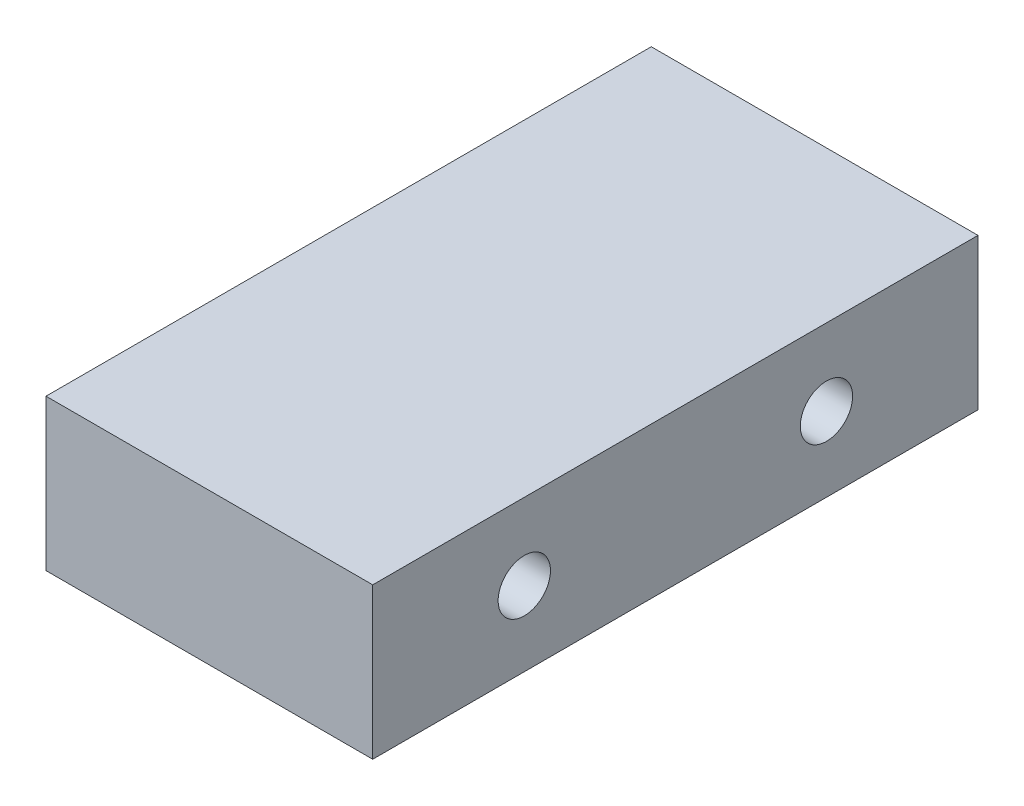
ISO-10303-21;
HEADER;
FILE_DESCRIPTION(('STEP AP214'),'2;1');
FILE_NAME('part.step','',(''),(''),'','','');
FILE_SCHEMA(('AUTOMOTIVE_DESIGN { 1 0 10303 214 1 1 1 1 }'));
ENDSEC;
DATA;
#1=APPLICATION_CONTEXT('core data for automotive mechanical design processes');
#2=APPLICATION_PROTOCOL_DEFINITION('international standard','automotive_design',2000,#1);
#3=PRODUCT_CONTEXT('',#1,'mechanical');
#4=PRODUCT('Part','Part','',(#3));
#5=PRODUCT_RELATED_PRODUCT_CATEGORY('part','',(#4));
#6=PRODUCT_DEFINITION_FORMATION('','',#4);
#7=PRODUCT_DEFINITION_CONTEXT('part definition',#1,'design');
#8=PRODUCT_DEFINITION('design','',#6,#7);
#9=PRODUCT_DEFINITION_SHAPE('','',#8);
#10=(LENGTH_UNIT() NAMED_UNIT(*) SI_UNIT(.MILLI.,.METRE.));
#11=(NAMED_UNIT(*) PLANE_ANGLE_UNIT() SI_UNIT($,.RADIAN.));
#12=(NAMED_UNIT(*) SI_UNIT($,.STERADIAN.) SOLID_ANGLE_UNIT());
#13=UNCERTAINTY_MEASURE_WITH_UNIT(LENGTH_MEASURE(1.E-05),#10,'distance_accuracy_value','');
#14=(GEOMETRIC_REPRESENTATION_CONTEXT(3) GLOBAL_UNCERTAINTY_ASSIGNED_CONTEXT((#13)) GLOBAL_UNIT_ASSIGNED_CONTEXT((#10,
#11,#12)) REPRESENTATION_CONTEXT('',''));
#15=CARTESIAN_POINT('',(0.,0.,0.));
#16=DIRECTION('',(0.,0.,1.));
#17=DIRECTION('',(1.,0.,0.));
#18=AXIS2_PLACEMENT_3D('',#15,#16,#17);
#19=CARTESIAN_POINT('',(-3.18,19.87,-19.09));
#20=DIRECTION('',(-1.,0.,0.));
#21=DIRECTION('',(0.,-1.,0.));
#22=AXIS2_PLACEMENT_3D('',#19,#20,#21);
#23=PLANE('',#22);
#24=DIRECTION('',(0.,0.628988215202953,0.777414834651232));
#25=VECTOR('',#24,1.);
#26=CARTESIAN_POINT('',(-3.18000000000001,0.,6.31));
#27=LINE('',#26,#25);
#28=CARTESIAN_POINT('',(-3.18000000000001,0.,6.31));
#29=VERTEX_POINT('',#28);
#30=CARTESIAN_POINT('',(-3.18,10.34,19.09));
#31=VERTEX_POINT('',#30);
#32=EDGE_CURVE('E92',#29,#31,#27,.T.);
#33=ORIENTED_EDGE('',*,*,#32,.T.);
#34=DIRECTION('',(0.,-1.,0.));
#35=VECTOR('',#34,1.);
#36=CARTESIAN_POINT('',(-3.18,19.87,19.09));
#37=LINE('',#36,#35);
#38=CARTESIAN_POINT('',(-3.18,19.87,19.09));
#39=VERTEX_POINT('',#38);
#40=EDGE_CURVE('E103',#39,#31,#37,.T.);
#41=ORIENTED_EDGE('',*,*,#40,.F.);
#42=DIRECTION('',(0.,0.,1.));
#43=VECTOR('',#42,1.);
#44=CARTESIAN_POINT('',(-3.18,19.87,-19.09));
#45=LINE('',#44,#43);
#46=CARTESIAN_POINT('',(-3.18,19.87,-19.09));
#47=VERTEX_POINT('',#46);
#48=EDGE_CURVE('E11',#47,#39,#45,.T.);
#49=ORIENTED_EDGE('',*,*,#48,.F.);
#50=DIRECTION('',(0.,-1.,0.));
#51=VECTOR('',#50,1.);
#52=CARTESIAN_POINT('',(-3.18,19.87,-19.09));
#53=LINE('',#52,#51);
#54=CARTESIAN_POINT('',(-3.18,10.34,-19.09));
#55=VERTEX_POINT('',#54);
#56=EDGE_CURVE('E123',#47,#55,#53,.T.);
#57=ORIENTED_EDGE('',*,*,#56,.T.);
#58=DIRECTION('',(0.,-0.628988215202953,0.777414834651232));
#59=VECTOR('',#58,1.);
#60=CARTESIAN_POINT('',(-3.18,10.34,-19.09));
#61=LINE('',#60,#59);
#62=CARTESIAN_POINT('',(-3.18000000000001,0.,-6.31));
#63=VERTEX_POINT('',#62);
#64=EDGE_CURVE('E47',#55,#63,#61,.T.);
#65=ORIENTED_EDGE('',*,*,#64,.T.);
#66=DIRECTION('',(0.,0.,1.));
#67=VECTOR('',#66,1.);
#68=CARTESIAN_POINT('',(-3.18,0.,-19.09));
#69=LINE('',#68,#67);
#70=EDGE_CURVE('E34',#63,#29,#69,.T.);
#71=ORIENTED_EDGE('',*,*,#70,.T.);
#72=EDGE_LOOP('',(#33,#41,#49,#57,#65,#71));
#73=FACE_BOUND('',#72,.T.);
#74=ADVANCED_FACE('F31',(#73),#23,.T.);
#75=CARTESIAN_POINT('',(17.43,19.87,-19.09));
#76=DIRECTION('',(0.,1.,0.));
#77=DIRECTION('',(-1.,0.,0.));
#78=AXIS2_PLACEMENT_3D('',#75,#76,#77);
#79=PLANE('',#78);
#80=ORIENTED_EDGE('',*,*,#48,.T.);
#81=DIRECTION('',(-1.,0.,0.));
#82=VECTOR('',#81,1.);
#83=CARTESIAN_POINT('',(17.43,19.87,19.09));
#84=LINE('',#83,#82);
#85=CARTESIAN_POINT('',(17.43,19.87,19.09));
#86=VERTEX_POINT('',#85);
#87=EDGE_CURVE('E110',#86,#39,#84,.T.);
#88=ORIENTED_EDGE('',*,*,#87,.F.);
#89=DIRECTION('',(0.,0.,1.));
#90=VECTOR('',#89,1.);
#91=CARTESIAN_POINT('',(17.43,19.87,-19.09));
#92=LINE('',#91,#90);
#93=CARTESIAN_POINT('',(17.43,19.87,-19.09));
#94=VERTEX_POINT('',#93);
#95=EDGE_CURVE('E39',#94,#86,#92,.T.);
#96=ORIENTED_EDGE('',*,*,#95,.F.);
#97=DIRECTION('',(-1.,0.,0.));
#98=VECTOR('',#97,1.);
#99=CARTESIAN_POINT('',(17.43,19.87,-19.09));
#100=LINE('',#99,#98);
#101=EDGE_CURVE('E131',#94,#47,#100,.T.);
#102=ORIENTED_EDGE('',*,*,#101,.T.);
#103=EDGE_LOOP('',(#80,#88,#96,#102));
#104=FACE_BOUND('',#103,.T.);
#105=ADVANCED_FACE('F170',(#104),#79,.T.);
#106=CARTESIAN_POINT('',(17.43,10.34,-19.09));
#107=DIRECTION('',(1.,0.,0.));
#108=DIRECTION('',(0.,0.,-1.));
#109=AXIS2_PLACEMENT_3D('',#106,#107,#108);
#110=PLANE('',#109);
#111=CARTESIAN_POINT('',(17.43,15.045,9.52999999999999));
#112=DIRECTION('',(1.,0.,0.));
#113=DIRECTION('',(0.,0.,-1.));
#114=AXIS2_PLACEMENT_3D('',#111,#112,#113);
#115=CIRCLE('',#114,1.65);
#116=CARTESIAN_POINT('',(17.43,15.045,7.87999999999999));
#117=VERTEX_POINT('',#116);
#118=EDGE_CURVE('E201',#117,#117,#115,.T.);
#119=ORIENTED_EDGE('',*,*,#118,.F.);
#120=EDGE_LOOP('',(#119));
#121=FACE_BOUND('',#120,.T.);
#122=CARTESIAN_POINT('',(17.43,15.045,-9.52999999999999));
#123=DIRECTION('',(1.,0.,0.));
#124=DIRECTION('',(0.,0.,-1.));
#125=AXIS2_PLACEMENT_3D('',#122,#123,#124);
#126=CIRCLE('',#125,1.65);
#127=CARTESIAN_POINT('',(17.43,15.045,-11.18));
#128=VERTEX_POINT('',#127);
#129=EDGE_CURVE('E195',#128,#128,#126,.T.);
#130=ORIENTED_EDGE('',*,*,#129,.F.);
#131=EDGE_LOOP('',(#130));
#132=FACE_BOUND('',#131,.T.);
#133=ORIENTED_EDGE('',*,*,#95,.T.);
#134=DIRECTION('',(0.,1.,0.));
#135=VECTOR('',#134,1.);
#136=CARTESIAN_POINT('',(17.43,10.34,19.09));
#137=LINE('',#136,#135);
#138=CARTESIAN_POINT('',(17.43,10.34,19.09));
#139=VERTEX_POINT('',#138);
#140=EDGE_CURVE('E114',#139,#86,#137,.T.);
#141=ORIENTED_EDGE('',*,*,#140,.F.);
#142=DIRECTION('',(0.,0.,1.));
#143=VECTOR('',#142,1.);
#144=CARTESIAN_POINT('',(17.43,10.34,-19.09));
#145=LINE('',#144,#143);
#146=CARTESIAN_POINT('',(17.43,10.34,-19.09));
#147=VERTEX_POINT('',#146);
#148=EDGE_CURVE('E135',#147,#139,#145,.T.);
#149=ORIENTED_EDGE('',*,*,#148,.F.);
#150=DIRECTION('',(0.,1.,0.));
#151=VECTOR('',#150,1.);
#152=CARTESIAN_POINT('',(17.43,10.34,-19.09));
#153=LINE('',#152,#151);
#154=EDGE_CURVE('E128',#147,#94,#153,.T.);
#155=ORIENTED_EDGE('',*,*,#154,.T.);
#156=EDGE_LOOP('',(#133,#141,#149,#155));
#157=FACE_BOUND('',#156,.T.);
#158=ADVANCED_FACE('F168',(#121,#132,#157),#110,.T.);
#159=CARTESIAN_POINT('',(3.18,10.34,-19.09));
#160=DIRECTION('',(0.,-1.,0.));
#161=DIRECTION('',(1.,0.,0.));
#162=AXIS2_PLACEMENT_3D('',#159,#160,#161);
#163=PLANE('',#162);
#164=ORIENTED_EDGE('',*,*,#148,.T.);
#165=DIRECTION('',(1.,0.,0.));
#166=VECTOR('',#165,1.);
#167=CARTESIAN_POINT('',(3.18,10.34,19.09));
#168=LINE('',#167,#166);
#169=CARTESIAN_POINT('',(3.18,10.34,19.09));
#170=VERTEX_POINT('',#169);
#171=EDGE_CURVE('E111',#170,#139,#168,.T.);
#172=ORIENTED_EDGE('',*,*,#171,.F.);
#173=DIRECTION('',(0.,0.,1.));
#174=VECTOR('',#173,1.);
#175=CARTESIAN_POINT('',(3.18,10.34,-19.09));
#176=LINE('',#175,#174);
#177=CARTESIAN_POINT('',(3.18,10.34,-19.09));
#178=VERTEX_POINT('',#177);
#179=EDGE_CURVE('E137',#178,#170,#176,.T.);
#180=ORIENTED_EDGE('',*,*,#179,.F.);
#181=DIRECTION('',(1.,0.,0.));
#182=VECTOR('',#181,1.);
#183=CARTESIAN_POINT('',(3.18,10.34,-19.09));
#184=LINE('',#183,#182);
#185=EDGE_CURVE('E125',#178,#147,#184,.T.);
#186=ORIENTED_EDGE('',*,*,#185,.T.);
#187=EDGE_LOOP('',(#164,#172,#180,#186));
#188=FACE_BOUND('',#187,.T.);
#189=ADVANCED_FACE('F165',(#188),#163,.T.);
#190=CARTESIAN_POINT('',(3.18,0.,-19.09));
#191=DIRECTION('',(1.,0.,0.));
#192=DIRECTION('',(0.,1.,0.));
#193=AXIS2_PLACEMENT_3D('',#190,#191,#192);
#194=PLANE('',#193);
#195=DIRECTION('',(0.,0.628988215202953,0.777414834651232));
#196=VECTOR('',#195,1.);
#197=CARTESIAN_POINT('',(3.18,0.,6.31));
#198=LINE('',#197,#196);
#199=CARTESIAN_POINT('',(3.18,0.,6.31));
#200=VERTEX_POINT('',#199);
#201=EDGE_CURVE('E95',#200,#170,#198,.T.);
#202=ORIENTED_EDGE('',*,*,#201,.F.);
#203=DIRECTION('',(0.,0.,1.));
#204=VECTOR('',#203,1.);
#205=CARTESIAN_POINT('',(3.18,0.,-19.09));
#206=LINE('',#205,#204);
#207=CARTESIAN_POINT('',(3.18,0.,-6.31));
#208=VERTEX_POINT('',#207);
#209=EDGE_CURVE('E138',#208,#200,#206,.T.);
#210=ORIENTED_EDGE('',*,*,#209,.F.);
#211=DIRECTION('',(0.,-0.628988215202953,0.777414834651232));
#212=VECTOR('',#211,1.);
#213=CARTESIAN_POINT('',(3.18,10.34,-19.09));
#214=LINE('',#213,#212);
#215=EDGE_CURVE('E146',#178,#208,#214,.T.);
#216=ORIENTED_EDGE('',*,*,#215,.F.);
#217=ORIENTED_EDGE('',*,*,#179,.T.);
#218=EDGE_LOOP('',(#202,#210,#216,#217));
#219=FACE_BOUND('',#218,.T.);
#220=ADVANCED_FACE('F145',(#219),#194,.T.);
#221=CARTESIAN_POINT('',(-3.18,0.,-19.09));
#222=DIRECTION('',(0.,-1.,0.));
#223=DIRECTION('',(0.,0.,-1.));
#224=AXIS2_PLACEMENT_3D('',#221,#222,#223);
#225=PLANE('',#224);
#226=CARTESIAN_POINT('',(0.,0.,0.));
#227=DIRECTION('',(0.,-1.,0.));
#228=DIRECTION('',(0.,0.,-1.));
#229=AXIS2_PLACEMENT_3D('',#226,#227,#228);
#230=CIRCLE('',#229,1.125);
#231=CARTESIAN_POINT('',(0.,0.,-1.125));
#232=VERTEX_POINT('',#231);
#233=EDGE_CURVE('E152',#232,#232,#230,.T.);
#234=ORIENTED_EDGE('',*,*,#233,.F.);
#235=EDGE_LOOP('',(#234));
#236=FACE_BOUND('',#235,.T.);
#237=DIRECTION('',(1.,0.,0.));
#238=VECTOR('',#237,1.);
#239=CARTESIAN_POINT('',(-3.18000000000001,0.,6.31));
#240=LINE('',#239,#238);
#241=EDGE_CURVE('E100',#29,#200,#240,.T.);
#242=ORIENTED_EDGE('',*,*,#241,.F.);
#243=ORIENTED_EDGE('',*,*,#70,.F.);
#244=DIRECTION('',(1.,0.,0.));
#245=VECTOR('',#244,1.);
#246=CARTESIAN_POINT('',(-3.18000000000001,0.,-6.31));
#247=LINE('',#246,#245);
#248=EDGE_CURVE('E112',#63,#208,#247,.T.);
#249=ORIENTED_EDGE('',*,*,#248,.T.);
#250=ORIENTED_EDGE('',*,*,#209,.T.);
#251=EDGE_LOOP('',(#242,#243,#249,#250));
#252=FACE_BOUND('',#251,.T.);
#253=ADVANCED_FACE('F142',(#236,#252),#225,.T.);
#254=CARTESIAN_POINT('',(-3.18,0.,-19.09));
#255=DIRECTION('',(0.,0.,1.));
#256=DIRECTION('',(1.,0.,0.));
#257=AXIS2_PLACEMENT_3D('',#254,#255,#256);
#258=PLANE('',#257);
#259=ORIENTED_EDGE('',*,*,#185,.F.);
#260=DIRECTION('',(1.,0.,0.));
#261=VECTOR('',#260,1.);
#262=CARTESIAN_POINT('',(-3.18,10.34,-19.09));
#263=LINE('',#262,#261);
#264=EDGE_CURVE('E117',#55,#178,#263,.T.);
#265=ORIENTED_EDGE('',*,*,#264,.F.);
#266=ORIENTED_EDGE('',*,*,#56,.F.);
#267=ORIENTED_EDGE('',*,*,#101,.F.);
#268=ORIENTED_EDGE('',*,*,#154,.F.);
#269=EDGE_LOOP('',(#259,#265,#266,#267,#268));
#270=FACE_BOUND('',#269,.T.);
#271=ADVANCED_FACE('F161',(#270),#258,.F.);
#272=CARTESIAN_POINT('',(-3.18,0.,19.09));
#273=DIRECTION('',(0.,0.,1.));
#274=DIRECTION('',(1.,0.,0.));
#275=AXIS2_PLACEMENT_3D('',#272,#273,#274);
#276=PLANE('',#275);
#277=DIRECTION('',(1.,0.,0.));
#278=VECTOR('',#277,1.);
#279=CARTESIAN_POINT('',(-3.18,10.34,19.09));
#280=LINE('',#279,#278);
#281=EDGE_CURVE('E89',#31,#170,#280,.T.);
#282=ORIENTED_EDGE('',*,*,#281,.T.);
#283=ORIENTED_EDGE('',*,*,#171,.T.);
#284=ORIENTED_EDGE('',*,*,#140,.T.);
#285=ORIENTED_EDGE('',*,*,#87,.T.);
#286=ORIENTED_EDGE('',*,*,#40,.T.);
#287=EDGE_LOOP('',(#282,#283,#284,#285,#286));
#288=FACE_BOUND('',#287,.T.);
#289=ADVANCED_FACE('F107',(#288),#276,.T.);
#290=CARTESIAN_POINT('',(-3.18,10.34,-19.09));
#291=DIRECTION('',(0.,0.777414834651233,0.628988215202953));
#292=DIRECTION('',(0.,-0.628988215202953,0.777414834651233));
#293=AXIS2_PLACEMENT_3D('',#290,#291,#292);
#294=PLANE('',#293);
#295=ORIENTED_EDGE('',*,*,#215,.T.);
#296=ORIENTED_EDGE('',*,*,#248,.F.);
#297=ORIENTED_EDGE('',*,*,#64,.F.);
#298=ORIENTED_EDGE('',*,*,#264,.T.);
#299=EDGE_LOOP('',(#295,#296,#297,#298));
#300=FACE_BOUND('',#299,.T.);
#301=ADVANCED_FACE('F158',(#300),#294,.F.);
#302=CARTESIAN_POINT('',(-3.18000000000001,0.,6.31));
#303=DIRECTION('',(0.,0.777414834651233,-0.628988215202953));
#304=DIRECTION('',(0.,0.628988215202953,0.777414834651233));
#305=AXIS2_PLACEMENT_3D('',#302,#303,#304);
#306=PLANE('',#305);
#307=ORIENTED_EDGE('',*,*,#201,.T.);
#308=ORIENTED_EDGE('',*,*,#281,.F.);
#309=ORIENTED_EDGE('',*,*,#32,.F.);
#310=ORIENTED_EDGE('',*,*,#241,.T.);
#311=EDGE_LOOP('',(#307,#308,#309,#310));
#312=FACE_BOUND('',#311,.T.);
#313=ADVANCED_FACE('F91',(#312),#306,.F.);
#314=CARTESIAN_POINT('',(0.,6.35,0.));
#315=DIRECTION('',(0.,-1.,0.));
#316=DIRECTION('',(0.,0.,-1.));
#317=AXIS2_PLACEMENT_3D('',#314,#315,#316);
#318=CYLINDRICAL_SURFACE('',#317,1.125);
#319=CARTESIAN_POINT('',(0.,6.35,0.));
#320=DIRECTION('',(0.,-1.,0.));
#321=DIRECTION('',(0.,0.,-1.));
#322=AXIS2_PLACEMENT_3D('',#319,#320,#321);
#323=CIRCLE('',#322,1.125);
#324=CARTESIAN_POINT('',(0.,6.35,-1.125));
#325=VERTEX_POINT('',#324);
#326=EDGE_CURVE('E149',#325,#325,#323,.T.);
#327=ORIENTED_EDGE('',*,*,#326,.F.);
#328=EDGE_LOOP('',(#327));
#329=FACE_BOUND('',#328,.T.);
#330=ORIENTED_EDGE('',*,*,#233,.T.);
#331=EDGE_LOOP('',(#330));
#332=FACE_BOUND('',#331,.T.);
#333=ADVANCED_FACE('F229',(#329,#332),#318,.F.);
#334=CARTESIAN_POINT('',(0.,6.35,0.));
#335=DIRECTION('',(0.,-1.,0.));
#336=DIRECTION('',(0.,0.,-1.));
#337=AXIS2_PLACEMENT_3D('',#334,#335,#336);
#338=PLANE('',#337);
#339=ORIENTED_EDGE('',*,*,#326,.T.);
#340=EDGE_LOOP('',(#339));
#341=FACE_BOUND('',#340,.T.);
#342=ADVANCED_FACE('F220',(#341),#338,.T.);
#343=CARTESIAN_POINT('',(2.43,15.045,-9.52999999999999));
#344=DIRECTION('',(1.,0.,0.));
#345=DIRECTION('',(0.,0.,-1.));
#346=AXIS2_PLACEMENT_3D('',#343,#344,#345);
#347=CYLINDRICAL_SURFACE('',#346,1.65);
#348=CARTESIAN_POINT('',(2.43,15.045,-9.52999999999999));
#349=DIRECTION('',(1.,0.,0.));
#350=DIRECTION('',(0.,0.,-1.));
#351=AXIS2_PLACEMENT_3D('',#348,#349,#350);
#352=CIRCLE('',#351,1.65);
#353=CARTESIAN_POINT('',(2.43,15.045,-11.18));
#354=VERTEX_POINT('',#353);
#355=EDGE_CURVE('E193',#354,#354,#352,.T.);
#356=ORIENTED_EDGE('',*,*,#355,.F.);
#357=EDGE_LOOP('',(#356));
#358=FACE_BOUND('',#357,.T.);
#359=ORIENTED_EDGE('',*,*,#129,.T.);
#360=EDGE_LOOP('',(#359));
#361=FACE_BOUND('',#360,.T.);
#362=ADVANCED_FACE('F218',(#358,#361),#347,.F.);
#363=CARTESIAN_POINT('',(2.43,15.045,-9.52999999999999));
#364=DIRECTION('',(1.,0.,0.));
#365=DIRECTION('',(0.,0.,-1.));
#366=AXIS2_PLACEMENT_3D('',#363,#364,#365);
#367=PLANE('',#366);
#368=ORIENTED_EDGE('',*,*,#355,.T.);
#369=EDGE_LOOP('',(#368));
#370=FACE_BOUND('',#369,.T.);
#371=ADVANCED_FACE('F212',(#370),#367,.T.);
#372=CARTESIAN_POINT('',(2.43,15.045,9.52999999999999));
#373=DIRECTION('',(1.,0.,0.));
#374=DIRECTION('',(0.,0.,-1.));
#375=AXIS2_PLACEMENT_3D('',#372,#373,#374);
#376=CYLINDRICAL_SURFACE('',#375,1.65);
#377=CARTESIAN_POINT('',(2.43,15.045,9.52999999999999));
#378=DIRECTION('',(1.,0.,0.));
#379=DIRECTION('',(0.,0.,-1.));
#380=AXIS2_PLACEMENT_3D('',#377,#378,#379);
#381=CIRCLE('',#380,1.65);
#382=CARTESIAN_POINT('',(2.43,15.045,7.87999999999999));
#383=VERTEX_POINT('',#382);
#384=EDGE_CURVE('E199',#383,#383,#381,.T.);
#385=ORIENTED_EDGE('',*,*,#384,.F.);
#386=EDGE_LOOP('',(#385));
#387=FACE_BOUND('',#386,.T.);
#388=ORIENTED_EDGE('',*,*,#118,.T.);
#389=EDGE_LOOP('',(#388));
#390=FACE_BOUND('',#389,.T.);
#391=ADVANCED_FACE('F209',(#387,#390),#376,.F.);
#392=CARTESIAN_POINT('',(2.43,15.045,9.52999999999999));
#393=DIRECTION('',(1.,0.,0.));
#394=DIRECTION('',(0.,0.,-1.));
#395=AXIS2_PLACEMENT_3D('',#392,#393,#394);
#396=PLANE('',#395);
#397=ORIENTED_EDGE('',*,*,#384,.T.);
#398=EDGE_LOOP('',(#397));
#399=FACE_BOUND('',#398,.T.);
#400=ADVANCED_FACE('F207',(#399),#396,.T.);
#401=CLOSED_SHELL('',(#74,#105,#158,#189,#220,#253,#271,#289,#301,#313,#333,#342,#362,#371,#391,#400));
#402=MANIFOLD_SOLID_BREP('B2',#401);
#403=ADVANCED_BREP_SHAPE_REPRESENTATION('',(#18,#402),#14);
#404=SHAPE_DEFINITION_REPRESENTATION(#9,#403);
ENDSEC;
END-ISO-10303-21;
